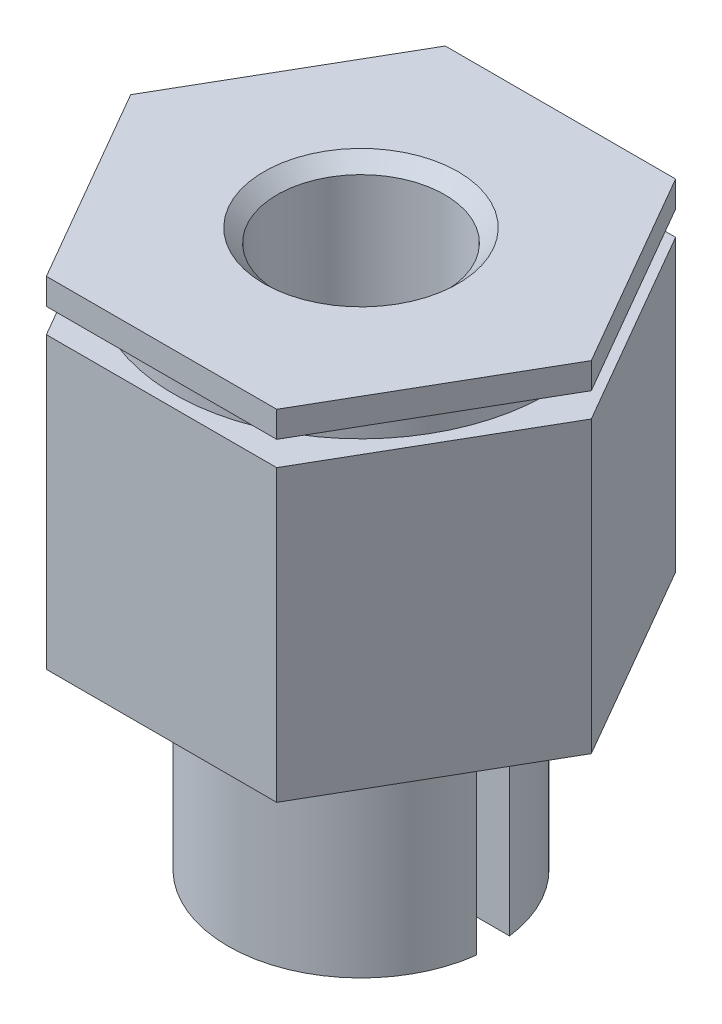
ISO-10303-21;
HEADER;
FILE_DESCRIPTION(('STEP AP214'),'2;1');
FILE_NAME('part.step','',(''),(''),'','','');
FILE_SCHEMA(('AUTOMOTIVE_DESIGN { 1 0 10303 214 1 1 1 1 }'));
ENDSEC;
DATA;
#1=APPLICATION_CONTEXT('core data for automotive mechanical design processes');
#2=APPLICATION_PROTOCOL_DEFINITION('international standard','automotive_design',2000,#1);
#3=PRODUCT_CONTEXT('',#1,'mechanical');
#4=PRODUCT('Part','Part','',(#3));
#5=PRODUCT_RELATED_PRODUCT_CATEGORY('part','',(#4));
#6=PRODUCT_DEFINITION_FORMATION('','',#4);
#7=PRODUCT_DEFINITION_CONTEXT('part definition',#1,'design');
#8=PRODUCT_DEFINITION('design','',#6,#7);
#9=PRODUCT_DEFINITION_SHAPE('','',#8);
#10=(LENGTH_UNIT() NAMED_UNIT(*) SI_UNIT(.MILLI.,.METRE.));
#11=(NAMED_UNIT(*) PLANE_ANGLE_UNIT() SI_UNIT($,.RADIAN.));
#12=(NAMED_UNIT(*) SI_UNIT($,.STERADIAN.) SOLID_ANGLE_UNIT());
#13=UNCERTAINTY_MEASURE_WITH_UNIT(LENGTH_MEASURE(1.E-05),#10,'distance_accuracy_value','');
#14=(GEOMETRIC_REPRESENTATION_CONTEXT(3) GLOBAL_UNCERTAINTY_ASSIGNED_CONTEXT((#13)) GLOBAL_UNIT_ASSIGNED_CONTEXT((#10,
#11,#12)) REPRESENTATION_CONTEXT('',''));
#15=CARTESIAN_POINT('',(0.,0.,0.));
#16=DIRECTION('',(0.,0.,1.));
#17=DIRECTION('',(1.,0.,0.));
#18=AXIS2_PLACEMENT_3D('',#15,#16,#17);
#19=CARTESIAN_POINT('',(0.,25.35682,0.));
#20=DIRECTION('',(0.,-1.,0.));
#21=DIRECTION('',(0.,0.,-1.));
#22=AXIS2_PLACEMENT_3D('',#19,#20,#21);
#23=CYLINDRICAL_SURFACE('',#22,8.9408);
#24=CARTESIAN_POINT('',(0.,24.13,0.));
#25=DIRECTION('',(0.,-1.,0.));
#26=DIRECTION('',(0.,0.,-1.));
#27=AXIS2_PLACEMENT_3D('',#24,#25,#26);
#28=CIRCLE('',#27,8.9408);
#29=CARTESIAN_POINT('',(0.,24.13,-8.9408));
#30=VERTEX_POINT('',#29);
#31=EDGE_CURVE('E19',#30,#30,#28,.F.);
#32=ORIENTED_EDGE('',*,*,#31,.T.);
#33=EDGE_LOOP('',(#32));
#34=FACE_BOUND('',#33,.T.);
#35=CARTESIAN_POINT('',(0.,25.2984,0.));
#36=DIRECTION('',(0.,-1.,0.));
#37=DIRECTION('',(0.,0.,-1.));
#38=AXIS2_PLACEMENT_3D('',#35,#36,#37);
#39=CIRCLE('',#38,8.9408);
#40=CARTESIAN_POINT('',(0.,25.2984,-8.9408));
#41=VERTEX_POINT('',#40);
#42=EDGE_CURVE('E192',#41,#41,#39,.F.);
#43=ORIENTED_EDGE('',*,*,#42,.F.);
#44=EDGE_LOOP('',(#43));
#45=FACE_BOUND('',#44,.T.);
#46=ADVANCED_FACE('F16',(#34,#45),#23,.T.);
#47=CARTESIAN_POINT('',(0.,24.13,0.));
#48=DIRECTION('',(0.,-1.,0.));
#49=DIRECTION('',(0.,0.,-1.));
#50=AXIS2_PLACEMENT_3D('',#47,#48,#49);
#51=PLANE('',#50);
#52=ORIENTED_EDGE('',*,*,#31,.F.);
#53=EDGE_LOOP('',(#52));
#54=FACE_BOUND('',#53,.T.);
#55=DIRECTION('',(-0.500000000000017,0.,-0.866025403784429));
#56=VECTOR('',#55,1.);
#57=CARTESIAN_POINT('',(10.9985226280619,24.13,0.));
#58=LINE('',#57,#56);
#59=CARTESIAN_POINT('',(5.49926131403085,24.13,-9.52499999999995));
#60=VERTEX_POINT('',#59);
#61=CARTESIAN_POINT('',(10.998522628062,24.13,0.));
#62=VERTEX_POINT('',#61);
#63=EDGE_CURVE('E171',#60,#62,#58,.F.);
#64=ORIENTED_EDGE('',*,*,#63,.F.);
#65=DIRECTION('',(-1.,0.,0.));
#66=VECTOR('',#65,1.);
#67=CARTESIAN_POINT('',(5.49926131403094,24.13,-9.525));
#68=LINE('',#67,#66);
#69=CARTESIAN_POINT('',(-5.49926131403094,24.13,-9.525));
#70=VERTEX_POINT('',#69);
#71=EDGE_CURVE('E177',#70,#60,#68,.F.);
#72=ORIENTED_EDGE('',*,*,#71,.F.);
#73=DIRECTION('',(-0.500000000000017,0.,0.866025403784429));
#74=VECTOR('',#73,1.);
#75=CARTESIAN_POINT('',(-5.49926131403094,24.13,-9.525));
#76=LINE('',#75,#74);
#77=CARTESIAN_POINT('',(-10.998522628062,24.13,0.));
#78=VERTEX_POINT('',#77);
#79=EDGE_CURVE('E183',#78,#70,#76,.F.);
#80=ORIENTED_EDGE('',*,*,#79,.F.);
#81=DIRECTION('',(0.500000000000017,0.,0.866025403784429));
#82=VECTOR('',#81,1.);
#83=CARTESIAN_POINT('',(-10.9985226280619,24.13,0.));
#84=LINE('',#83,#82);
#85=CARTESIAN_POINT('',(-5.49926131403075,24.13,9.5249999999999));
#86=VERTEX_POINT('',#85);
#87=EDGE_CURVE('E189',#86,#78,#84,.F.);
#88=ORIENTED_EDGE('',*,*,#87,.F.);
#89=DIRECTION('',(1.,0.,0.));
#90=VECTOR('',#89,1.);
#91=CARTESIAN_POINT('',(-5.49926131403094,24.13,9.525));
#92=LINE('',#91,#90);
#93=CARTESIAN_POINT('',(5.49926131403094,24.13,9.525));
#94=VERTEX_POINT('',#93);
#95=EDGE_CURVE('E156',#94,#86,#92,.F.);
#96=ORIENTED_EDGE('',*,*,#95,.F.);
#97=DIRECTION('',(0.500000000000017,0.,-0.866025403784429));
#98=VECTOR('',#97,1.);
#99=CARTESIAN_POINT('',(5.49926131403094,24.13,9.525));
#100=LINE('',#99,#98);
#101=EDGE_CURVE('E165',#62,#94,#100,.F.);
#102=ORIENTED_EDGE('',*,*,#101,.F.);
#103=EDGE_LOOP('',(#64,#72,#80,#88,#96,#102));
#104=FACE_BOUND('',#103,.T.);
#105=ADVANCED_FACE('F222',(#54,#104),#51,.F.);
#106=CARTESIAN_POINT('',(0.,25.2984,0.));
#107=DIRECTION('',(0.,-1.,0.));
#108=DIRECTION('',(0.,0.,-1.));
#109=AXIS2_PLACEMENT_3D('',#106,#107,#108);
#110=PLANE('',#109);
#111=ORIENTED_EDGE('',*,*,#42,.T.);
#112=EDGE_LOOP('',(#111));
#113=FACE_BOUND('',#112,.T.);
#114=DIRECTION('',(0.500000000000017,0.,-0.866025403784429));
#115=VECTOR('',#114,1.);
#116=CARTESIAN_POINT('',(5.49926131403094,25.2984,9.525));
#117=LINE('',#116,#115);
#118=CARTESIAN_POINT('',(5.49926131403094,25.2984,9.525));
#119=VERTEX_POINT('',#118);
#120=CARTESIAN_POINT('',(10.9985226280621,25.2984,1.05182136285921E-13));
#121=VERTEX_POINT('',#120);
#122=EDGE_CURVE('E153',#119,#121,#117,.T.);
#123=ORIENTED_EDGE('',*,*,#122,.F.);
#124=DIRECTION('',(1.,0.,0.));
#125=VECTOR('',#124,1.);
#126=CARTESIAN_POINT('',(-5.49926131403094,25.2984,9.525));
#127=LINE('',#126,#125);
#128=CARTESIAN_POINT('',(-5.49926131403075,25.2984,9.5249999999999));
#129=VERTEX_POINT('',#128);
#130=EDGE_CURVE('E119',#129,#119,#127,.T.);
#131=ORIENTED_EDGE('',*,*,#130,.F.);
#132=DIRECTION('',(0.500000000000017,0.,0.866025403784429));
#133=VECTOR('',#132,1.);
#134=CARTESIAN_POINT('',(-10.9985226280619,25.2984,0.));
#135=LINE('',#134,#133);
#136=CARTESIAN_POINT('',(-10.9985226280621,25.2984,-1.05182136285921E-13));
#137=VERTEX_POINT('',#136);
#138=EDGE_CURVE('E129',#137,#129,#135,.T.);
#139=ORIENTED_EDGE('',*,*,#138,.F.);
#140=DIRECTION('',(-0.500000000000017,0.,0.866025403784429));
#141=VECTOR('',#140,1.);
#142=CARTESIAN_POINT('',(-5.49926131403094,25.2984,-9.525));
#143=LINE('',#142,#141);
#144=CARTESIAN_POINT('',(-5.49926131403094,25.2984,-9.525));
#145=VERTEX_POINT('',#144);
#146=EDGE_CURVE('E135',#145,#137,#143,.T.);
#147=ORIENTED_EDGE('',*,*,#146,.F.);
#148=DIRECTION('',(-1.,0.,0.));
#149=VECTOR('',#148,1.);
#150=CARTESIAN_POINT('',(5.49926131403094,25.2984,-9.525));
#151=LINE('',#150,#149);
#152=CARTESIAN_POINT('',(5.49926131403075,25.2984,-9.5249999999999));
#153=VERTEX_POINT('',#152);
#154=EDGE_CURVE('E141',#153,#145,#151,.T.);
#155=ORIENTED_EDGE('',*,*,#154,.F.);
#156=DIRECTION('',(-0.500000000000017,0.,-0.866025403784429));
#157=VECTOR('',#156,1.);
#158=CARTESIAN_POINT('',(10.9985226280619,25.2984,0.));
#159=LINE('',#158,#157);
#160=EDGE_CURVE('E147',#121,#153,#159,.T.);
#161=ORIENTED_EDGE('',*,*,#160,.F.);
#162=EDGE_LOOP('',(#123,#131,#139,#147,#155,#161));
#163=FACE_BOUND('',#162,.T.);
#164=ADVANCED_FACE('F225',(#113,#163),#110,.T.);
#165=CARTESIAN_POINT('',(-10.9985226280619,0.,0.));
#166=DIRECTION('',(-0.866025403784429,0.,0.500000000000017));
#167=DIRECTION('',(0.500000000000017,0.,0.866025403784429));
#168=AXIS2_PLACEMENT_3D('',#165,#166,#167);
#169=PLANE('',#168);
#170=DIRECTION('',(0.,1.,0.));
#171=VECTOR('',#170,1.);
#172=CARTESIAN_POINT('',(-5.49926131403094,0.,9.525));
#173=LINE('',#172,#171);
#174=CARTESIAN_POINT('',(-5.49926131403075,10.287,9.5249999999999));
#175=VERTEX_POINT('',#174);
#176=EDGE_CURVE('E162',#86,#175,#173,.F.);
#177=ORIENTED_EDGE('',*,*,#176,.F.);
#178=ORIENTED_EDGE('',*,*,#87,.T.);
#179=DIRECTION('',(0.,1.,0.));
#180=VECTOR('',#179,1.);
#181=CARTESIAN_POINT('',(-10.9985226280622,0.,-2.09901540593194E-13));
#182=LINE('',#181,#180);
#183=CARTESIAN_POINT('',(-10.998522628062,10.287,0.));
#184=VERTEX_POINT('',#183);
#185=EDGE_CURVE('E186',#184,#78,#182,.T.);
#186=ORIENTED_EDGE('',*,*,#185,.F.);
#187=DIRECTION('',(-0.499999999999983,0.,-0.866025403784448));
#188=VECTOR('',#187,1.);
#189=CARTESIAN_POINT('',(-5.49926131403094,10.287,9.525));
#190=LINE('',#189,#188);
#191=EDGE_CURVE('E122',#175,#184,#190,.T.);
#192=ORIENTED_EDGE('',*,*,#191,.F.);
#193=EDGE_LOOP('',(#177,#178,#186,#192));
#194=FACE_BOUND('',#193,.T.);
#195=ADVANCED_FACE('F367',(#194),#169,.T.);
#196=CARTESIAN_POINT('',(-5.49926131403094,0.,-9.525));
#197=DIRECTION('',(-0.866025403784429,0.,-0.500000000000017));
#198=DIRECTION('',(-0.500000000000017,0.,0.866025403784429));
#199=AXIS2_PLACEMENT_3D('',#196,#197,#198);
#200=PLANE('',#199);
#201=ORIENTED_EDGE('',*,*,#185,.T.);
#202=ORIENTED_EDGE('',*,*,#79,.T.);
#203=DIRECTION('',(0.,1.,0.));
#204=VECTOR('',#203,1.);
#205=CARTESIAN_POINT('',(-5.49926131403094,0.,-9.525));
#206=LINE('',#205,#204);
#207=CARTESIAN_POINT('',(-5.49926131403094,10.287,-9.525));
#208=VERTEX_POINT('',#207);
#209=EDGE_CURVE('E180',#208,#70,#206,.T.);
#210=ORIENTED_EDGE('',*,*,#209,.F.);
#211=DIRECTION('',(0.499999999999983,0.,-0.866025403784448));
#212=VECTOR('',#211,1.);
#213=CARTESIAN_POINT('',(-10.9985226280619,10.287,0.));
#214=LINE('',#213,#212);
#215=EDGE_CURVE('E265',#184,#208,#214,.T.);
#216=ORIENTED_EDGE('',*,*,#215,.F.);
#217=EDGE_LOOP('',(#201,#202,#210,#216));
#218=FACE_BOUND('',#217,.T.);
#219=ADVANCED_FACE('F371',(#218),#200,.T.);
#220=CARTESIAN_POINT('',(5.49926131403094,0.,-9.525));
#221=DIRECTION('',(0.,0.,-1.));
#222=DIRECTION('',(-1.,0.,0.));
#223=AXIS2_PLACEMENT_3D('',#220,#221,#222);
#224=PLANE('',#223);
#225=ORIENTED_EDGE('',*,*,#209,.T.);
#226=ORIENTED_EDGE('',*,*,#71,.T.);
#227=DIRECTION('',(0.,1.,0.));
#228=VECTOR('',#227,1.);
#229=CARTESIAN_POINT('',(5.49926131403057,0.,-9.52499999999979));
#230=LINE('',#229,#228);
#231=CARTESIAN_POINT('',(5.49926131403085,10.287,-9.52499999999995));
#232=VERTEX_POINT('',#231);
#233=EDGE_CURVE('E174',#232,#60,#230,.T.);
#234=ORIENTED_EDGE('',*,*,#233,.F.);
#235=DIRECTION('',(1.,0.,0.));
#236=VECTOR('',#235,1.);
#237=CARTESIAN_POINT('',(0.,10.287,-9.525));
#238=LINE('',#237,#236);
#239=EDGE_CURVE('E259',#208,#232,#238,.T.);
#240=ORIENTED_EDGE('',*,*,#239,.F.);
#241=EDGE_LOOP('',(#225,#226,#234,#240));
#242=FACE_BOUND('',#241,.T.);
#243=ADVANCED_FACE('F571',(#242),#224,.T.);
#244=CARTESIAN_POINT('',(10.9985226280619,0.,0.));
#245=DIRECTION('',(0.866025403784429,0.,-0.500000000000017));
#246=DIRECTION('',(-0.500000000000017,0.,-0.866025403784429));
#247=AXIS2_PLACEMENT_3D('',#244,#245,#246);
#248=PLANE('',#247);
#249=ORIENTED_EDGE('',*,*,#233,.T.);
#250=ORIENTED_EDGE('',*,*,#63,.T.);
#251=DIRECTION('',(0.,1.,0.));
#252=VECTOR('',#251,1.);
#253=CARTESIAN_POINT('',(10.9985226280622,0.,2.09901540593194E-13));
#254=LINE('',#253,#252);
#255=CARTESIAN_POINT('',(10.998522628062,10.287,0.));
#256=VERTEX_POINT('',#255);
#257=EDGE_CURVE('E168',#256,#62,#254,.T.);
#258=ORIENTED_EDGE('',*,*,#257,.F.);
#259=DIRECTION('',(0.499999999999983,0.,0.866025403784448));
#260=VECTOR('',#259,1.);
#261=CARTESIAN_POINT('',(5.49926131403094,10.287,-9.525));
#262=LINE('',#261,#260);
#263=EDGE_CURVE('E256',#232,#256,#262,.T.);
#264=ORIENTED_EDGE('',*,*,#263,.F.);
#265=EDGE_LOOP('',(#249,#250,#258,#264));
#266=FACE_BOUND('',#265,.T.);
#267=ADVANCED_FACE('F237',(#266),#248,.T.);
#268=CARTESIAN_POINT('',(5.49926131403094,0.,9.525));
#269=DIRECTION('',(0.866025403784429,0.,0.500000000000017));
#270=DIRECTION('',(0.500000000000017,0.,-0.866025403784429));
#271=AXIS2_PLACEMENT_3D('',#268,#269,#270);
#272=PLANE('',#271);
#273=ORIENTED_EDGE('',*,*,#257,.T.);
#274=ORIENTED_EDGE('',*,*,#101,.T.);
#275=DIRECTION('',(0.,1.,0.));
#276=VECTOR('',#275,1.);
#277=CARTESIAN_POINT('',(5.49926131403094,0.,9.525));
#278=LINE('',#277,#276);
#279=CARTESIAN_POINT('',(5.49926131403094,10.287,9.525));
#280=VERTEX_POINT('',#279);
#281=EDGE_CURVE('E159',#280,#94,#278,.T.);
#282=ORIENTED_EDGE('',*,*,#281,.F.);
#283=DIRECTION('',(-0.499999999999983,0.,0.866025403784448));
#284=VECTOR('',#283,1.);
#285=CARTESIAN_POINT('',(10.9985226280619,10.287,0.));
#286=LINE('',#285,#284);
#287=EDGE_CURVE('E249',#256,#280,#286,.T.);
#288=ORIENTED_EDGE('',*,*,#287,.F.);
#289=EDGE_LOOP('',(#273,#274,#282,#288));
#290=FACE_BOUND('',#289,.T.);
#291=ADVANCED_FACE('F245',(#290),#272,.T.);
#292=CARTESIAN_POINT('',(-5.49926131403094,0.,9.525));
#293=DIRECTION('',(0.,0.,1.));
#294=DIRECTION('',(1.,0.,0.));
#295=AXIS2_PLACEMENT_3D('',#292,#293,#294);
#296=PLANE('',#295);
#297=ORIENTED_EDGE('',*,*,#281,.T.);
#298=ORIENTED_EDGE('',*,*,#95,.T.);
#299=ORIENTED_EDGE('',*,*,#176,.T.);
#300=DIRECTION('',(1.,0.,0.));
#301=VECTOR('',#300,1.);
#302=CARTESIAN_POINT('',(0.,10.287,9.525));
#303=LINE('',#302,#301);
#304=EDGE_CURVE('E213',#280,#175,#303,.F.);
#305=ORIENTED_EDGE('',*,*,#304,.F.);
#306=EDGE_LOOP('',(#297,#298,#299,#305));
#307=FACE_BOUND('',#306,.T.);
#308=ADVANCED_FACE('F375',(#307),#296,.T.);
#309=CARTESIAN_POINT('',(5.49926131403094,0.,9.525));
#310=DIRECTION('',(0.866025403784429,0.,0.500000000000017));
#311=DIRECTION('',(0.500000000000017,0.,-0.866025403784429));
#312=AXIS2_PLACEMENT_3D('',#309,#310,#311);
#313=PLANE('',#312);
#314=DIRECTION('',(0.,1.,0.));
#315=VECTOR('',#314,1.);
#316=CARTESIAN_POINT('',(5.49926131403094,0.,9.525));
#317=LINE('',#316,#315);
#318=CARTESIAN_POINT('',(5.49926131403094,26.543,9.525));
#319=VERTEX_POINT('',#318);
#320=EDGE_CURVE('E126',#119,#319,#317,.T.);
#321=ORIENTED_EDGE('',*,*,#320,.F.);
#322=ORIENTED_EDGE('',*,*,#122,.T.);
#323=DIRECTION('',(0.,1.,0.));
#324=VECTOR('',#323,1.);
#325=CARTESIAN_POINT('',(10.9985226280619,0.,0.));
#326=LINE('',#325,#324);
#327=CARTESIAN_POINT('',(10.9985226280621,26.543,1.03852042569284E-13));
#328=VERTEX_POINT('',#327);
#329=EDGE_CURVE('E150',#328,#121,#326,.F.);
#330=ORIENTED_EDGE('',*,*,#329,.F.);
#331=DIRECTION('',(0.499999999999983,0.,-0.866025403784448));
#332=VECTOR('',#331,1.);
#333=CARTESIAN_POINT('',(5.49926131403094,26.543,9.525));
#334=LINE('',#333,#332);
#335=EDGE_CURVE('E100',#319,#328,#334,.T.);
#336=ORIENTED_EDGE('',*,*,#335,.F.);
#337=EDGE_LOOP('',(#321,#322,#330,#336));
#338=FACE_BOUND('',#337,.T.);
#339=ADVANCED_FACE('F319',(#338),#313,.T.);
#340=CARTESIAN_POINT('',(10.9985226280619,0.,0.));
#341=DIRECTION('',(0.866025403784429,0.,-0.500000000000017));
#342=DIRECTION('',(-0.500000000000017,0.,-0.866025403784429));
#343=AXIS2_PLACEMENT_3D('',#340,#341,#342);
#344=PLANE('',#343);
#345=ORIENTED_EDGE('',*,*,#329,.T.);
#346=ORIENTED_EDGE('',*,*,#160,.T.);
#347=DIRECTION('',(0.,1.,0.));
#348=VECTOR('',#347,1.);
#349=CARTESIAN_POINT('',(5.49926131403094,0.,-9.525));
#350=LINE('',#349,#348);
#351=CARTESIAN_POINT('',(5.49926131403075,26.543,-9.5249999999999));
#352=VERTEX_POINT('',#351);
#353=EDGE_CURVE('E144',#352,#153,#350,.F.);
#354=ORIENTED_EDGE('',*,*,#353,.F.);
#355=DIRECTION('',(-0.499999999999983,0.,-0.866025403784448));
#356=VECTOR('',#355,1.);
#357=CARTESIAN_POINT('',(10.9985226280619,26.543,0.));
#358=LINE('',#357,#356);
#359=EDGE_CURVE('E303',#328,#352,#358,.T.);
#360=ORIENTED_EDGE('',*,*,#359,.F.);
#361=EDGE_LOOP('',(#345,#346,#354,#360));
#362=FACE_BOUND('',#361,.T.);
#363=ADVANCED_FACE('F324',(#362),#344,.T.);
#364=CARTESIAN_POINT('',(5.49926131403094,0.,-9.525));
#365=DIRECTION('',(0.,0.,-1.));
#366=DIRECTION('',(-1.,0.,0.));
#367=AXIS2_PLACEMENT_3D('',#364,#365,#366);
#368=PLANE('',#367);
#369=ORIENTED_EDGE('',*,*,#353,.T.);
#370=ORIENTED_EDGE('',*,*,#154,.T.);
#371=DIRECTION('',(0.,1.,0.));
#372=VECTOR('',#371,1.);
#373=CARTESIAN_POINT('',(-5.49926131403094,0.,-9.525));
#374=LINE('',#373,#372);
#375=CARTESIAN_POINT('',(-5.49926131403094,26.543,-9.525));
#376=VERTEX_POINT('',#375);
#377=EDGE_CURVE('E138',#376,#145,#374,.F.);
#378=ORIENTED_EDGE('',*,*,#377,.F.);
#379=DIRECTION('',(1.,0.,0.));
#380=VECTOR('',#379,1.);
#381=CARTESIAN_POINT('',(0.,26.543,-9.525));
#382=LINE('',#381,#380);
#383=EDGE_CURVE('E300',#352,#376,#382,.F.);
#384=ORIENTED_EDGE('',*,*,#383,.F.);
#385=EDGE_LOOP('',(#369,#370,#378,#384));
#386=FACE_BOUND('',#385,.T.);
#387=ADVANCED_FACE('F332',(#386),#368,.T.);
#388=CARTESIAN_POINT('',(-5.49926131403094,0.,-9.525));
#389=DIRECTION('',(-0.866025403784429,0.,-0.500000000000017));
#390=DIRECTION('',(-0.500000000000017,0.,0.866025403784429));
#391=AXIS2_PLACEMENT_3D('',#388,#389,#390);
#392=PLANE('',#391);
#393=ORIENTED_EDGE('',*,*,#377,.T.);
#394=ORIENTED_EDGE('',*,*,#146,.T.);
#395=DIRECTION('',(0.,1.,0.));
#396=VECTOR('',#395,1.);
#397=CARTESIAN_POINT('',(-10.9985226280619,0.,0.));
#398=LINE('',#397,#396);
#399=CARTESIAN_POINT('',(-10.9985226280621,26.543,-1.03852042569284E-13));
#400=VERTEX_POINT('',#399);
#401=EDGE_CURVE('E132',#400,#137,#398,.F.);
#402=ORIENTED_EDGE('',*,*,#401,.F.);
#403=DIRECTION('',(-0.499999999999983,0.,0.866025403784448));
#404=VECTOR('',#403,1.);
#405=CARTESIAN_POINT('',(-5.49926131403094,26.543,-9.525));
#406=LINE('',#405,#404);
#407=EDGE_CURVE('E297',#376,#400,#406,.T.);
#408=ORIENTED_EDGE('',*,*,#407,.F.);
#409=EDGE_LOOP('',(#393,#394,#402,#408));
#410=FACE_BOUND('',#409,.T.);
#411=ADVANCED_FACE('F435',(#410),#392,.T.);
#412=CARTESIAN_POINT('',(-10.9985226280619,0.,0.));
#413=DIRECTION('',(-0.866025403784429,0.,0.500000000000017));
#414=DIRECTION('',(0.500000000000017,0.,0.866025403784429));
#415=AXIS2_PLACEMENT_3D('',#412,#413,#414);
#416=PLANE('',#415);
#417=ORIENTED_EDGE('',*,*,#401,.T.);
#418=ORIENTED_EDGE('',*,*,#138,.T.);
#419=DIRECTION('',(0.,1.,0.));
#420=VECTOR('',#419,1.);
#421=CARTESIAN_POINT('',(-5.49926131403094,0.,9.525));
#422=LINE('',#421,#420);
#423=CARTESIAN_POINT('',(-5.49926131403075,26.543,9.5249999999999));
#424=VERTEX_POINT('',#423);
#425=EDGE_CURVE('E123',#424,#129,#422,.F.);
#426=ORIENTED_EDGE('',*,*,#425,.F.);
#427=DIRECTION('',(0.499999999999983,0.,0.866025403784448));
#428=VECTOR('',#427,1.);
#429=CARTESIAN_POINT('',(-10.9985226280619,26.543,0.));
#430=LINE('',#429,#428);
#431=EDGE_CURVE('E294',#400,#424,#430,.T.);
#432=ORIENTED_EDGE('',*,*,#431,.F.);
#433=EDGE_LOOP('',(#417,#418,#426,#432));
#434=FACE_BOUND('',#433,.T.);
#435=ADVANCED_FACE('F431',(#434),#416,.T.);
#436=CARTESIAN_POINT('',(-5.49926131403094,0.,9.525));
#437=DIRECTION('',(0.,0.,1.));
#438=DIRECTION('',(1.,0.,0.));
#439=AXIS2_PLACEMENT_3D('',#436,#437,#438);
#440=PLANE('',#439);
#441=ORIENTED_EDGE('',*,*,#425,.T.);
#442=ORIENTED_EDGE('',*,*,#130,.T.);
#443=ORIENTED_EDGE('',*,*,#320,.T.);
#444=DIRECTION('',(1.,0.,0.));
#445=VECTOR('',#444,1.);
#446=CARTESIAN_POINT('',(0.,26.543,9.525));
#447=LINE('',#446,#445);
#448=EDGE_CURVE('E291',#424,#319,#447,.T.);
#449=ORIENTED_EDGE('',*,*,#448,.F.);
#450=EDGE_LOOP('',(#441,#442,#443,#449));
#451=FACE_BOUND('',#450,.T.);
#452=ADVANCED_FACE('F428',(#451),#440,.T.);
#453=CARTESIAN_POINT('',(0.,0.,0.));
#454=DIRECTION('',(0.,-1.,0.));
#455=DIRECTION('',(0.,0.,-1.));
#456=AXIS2_PLACEMENT_3D('',#453,#454,#455);
#457=CYLINDRICAL_SURFACE('',#456,6.35);
#458=CARTESIAN_POINT('',(0.,0.,0.));
#459=DIRECTION('',(0.,-1.,0.));
#460=DIRECTION('',(0.,0.,-1.));
#461=AXIS2_PLACEMENT_3D('',#458,#459,#460);
#462=CIRCLE('',#461,6.35);
#463=CARTESIAN_POINT('',(6.30019530947249,0.,-0.79375));
#464=VERTEX_POINT('',#463);
#465=CARTESIAN_POINT('',(-6.30019530947249,0.,-0.79375));
#466=VERTEX_POINT('',#465);
#467=EDGE_CURVE('E109',#464,#466,#462,.F.);
#468=ORIENTED_EDGE('',*,*,#467,.T.);
#469=DIRECTION('',(0.,1.,0.));
#470=VECTOR('',#469,1.);
#471=CARTESIAN_POINT('',(-6.30019530947242,0.,-0.79375));
#472=LINE('',#471,#470);
#473=CARTESIAN_POINT('',(-6.30019530947249,10.287,-0.79375));
#474=VERTEX_POINT('',#473);
#475=EDGE_CURVE('E103',#466,#474,#472,.T.);
#476=ORIENTED_EDGE('',*,*,#475,.T.);
#477=CARTESIAN_POINT('',(0.,10.287,0.));
#478=DIRECTION('',(0.,-1.,0.));
#479=DIRECTION('',(0.,0.,-1.));
#480=AXIS2_PLACEMENT_3D('',#477,#478,#479);
#481=CIRCLE('',#480,6.35);
#482=CARTESIAN_POINT('',(6.30019530947249,10.287,-0.79375));
#483=VERTEX_POINT('',#482);
#484=EDGE_CURVE('E90',#483,#474,#481,.F.);
#485=ORIENTED_EDGE('',*,*,#484,.F.);
#486=DIRECTION('',(0.,1.,0.));
#487=VECTOR('',#486,1.);
#488=CARTESIAN_POINT('',(6.30019530947242,0.,-0.79375));
#489=LINE('',#488,#487);
#490=EDGE_CURVE('E116',#483,#464,#489,.F.);
#491=ORIENTED_EDGE('',*,*,#490,.T.);
#492=EDGE_LOOP('',(#468,#476,#485,#491));
#493=FACE_BOUND('',#492,.T.);
#494=ADVANCED_FACE('F107',(#493),#457,.T.);
#495=CARTESIAN_POINT('',(0.,0.,0.));
#496=DIRECTION('',(0.,-1.,0.));
#497=DIRECTION('',(0.,0.,-1.));
#498=AXIS2_PLACEMENT_3D('',#495,#496,#497);
#499=CYLINDRICAL_SURFACE('',#498,6.35);
#500=CARTESIAN_POINT('',(0.,0.,0.));
#501=DIRECTION('',(0.,-1.,0.));
#502=DIRECTION('',(0.,0.,-1.));
#503=AXIS2_PLACEMENT_3D('',#500,#501,#502);
#504=CIRCLE('',#503,6.35);
#505=CARTESIAN_POINT('',(-6.30019530947249,0.,0.79375));
#506=VERTEX_POINT('',#505);
#507=CARTESIAN_POINT('',(6.30019530947249,0.,0.79375));
#508=VERTEX_POINT('',#507);
#509=EDGE_CURVE('E205',#506,#508,#504,.F.);
#510=ORIENTED_EDGE('',*,*,#509,.T.);
#511=DIRECTION('',(0.,1.,0.));
#512=VECTOR('',#511,1.);
#513=CARTESIAN_POINT('',(6.30019530947242,0.,0.79375));
#514=LINE('',#513,#512);
#515=CARTESIAN_POINT('',(6.30019530947249,10.287,0.79375));
#516=VERTEX_POINT('',#515);
#517=EDGE_CURVE('E270',#508,#516,#514,.T.);
#518=ORIENTED_EDGE('',*,*,#517,.T.);
#519=CARTESIAN_POINT('',(0.,10.287,0.));
#520=DIRECTION('',(0.,-1.,0.));
#521=DIRECTION('',(0.,0.,-1.));
#522=AXIS2_PLACEMENT_3D('',#519,#520,#521);
#523=CIRCLE('',#522,6.35);
#524=CARTESIAN_POINT('',(-6.30019530947249,10.287,0.79375));
#525=VERTEX_POINT('',#524);
#526=EDGE_CURVE('E211',#525,#516,#523,.F.);
#527=ORIENTED_EDGE('',*,*,#526,.F.);
#528=DIRECTION('',(0.,1.,0.));
#529=VECTOR('',#528,1.);
#530=CARTESIAN_POINT('',(-6.30019530947242,0.,0.79375));
#531=LINE('',#530,#529);
#532=EDGE_CURVE('E113',#525,#506,#531,.F.);
#533=ORIENTED_EDGE('',*,*,#532,.T.);
#534=EDGE_LOOP('',(#510,#518,#527,#533));
#535=FACE_BOUND('',#534,.T.);
#536=ADVANCED_FACE('F422',(#535),#499,.T.);
#537=CARTESIAN_POINT('',(0.,10.287,0.));
#538=DIRECTION('',(0.,-1.,0.));
#539=DIRECTION('',(0.,0.,-1.));
#540=AXIS2_PLACEMENT_3D('',#537,#538,#539);
#541=PLANE('',#540);
#542=DIRECTION('',(-1.,0.,0.));
#543=VECTOR('',#542,1.);
#544=CARTESIAN_POINT('',(-6.30019530947242,10.287,-0.79375));
#545=LINE('',#544,#543);
#546=CARTESIAN_POINT('',(3.92045417490044,10.287,-0.793749999999772));
#547=VERTEX_POINT('',#546);
#548=EDGE_CURVE('E96',#547,#483,#545,.F.);
#549=ORIENTED_EDGE('',*,*,#548,.T.);
#550=ORIENTED_EDGE('',*,*,#484,.T.);
#551=DIRECTION('',(-1.,0.,0.));
#552=VECTOR('',#551,1.);
#553=CARTESIAN_POINT('',(-6.30019530947242,10.287,-0.79375));
#554=LINE('',#553,#552);
#555=CARTESIAN_POINT('',(-3.92045417490039,10.287,-0.793750000000019));
#556=VERTEX_POINT('',#555);
#557=EDGE_CURVE('E94',#474,#556,#554,.F.);
#558=ORIENTED_EDGE('',*,*,#557,.T.);
#559=CARTESIAN_POINT('',(0.,10.287,0.));
#560=DIRECTION('',(0.,1.,0.));
#561=DIRECTION('',(0.,0.,1.));
#562=AXIS2_PLACEMENT_3D('',#559,#560,#561);
#563=CIRCLE('',#562,3.99999999999924);
#564=CARTESIAN_POINT('',(-3.92045417490039,10.287,0.793750000000019));
#565=VERTEX_POINT('',#564);
#566=EDGE_CURVE('E57',#556,#565,#563,.T.);
#567=ORIENTED_EDGE('',*,*,#566,.T.);
#568=DIRECTION('',(1.,0.,0.));
#569=VECTOR('',#568,1.);
#570=CARTESIAN_POINT('',(6.30019530947242,10.287,0.79375));
#571=LINE('',#570,#569);
#572=EDGE_CURVE('E105',#565,#525,#571,.F.);
#573=ORIENTED_EDGE('',*,*,#572,.T.);
#574=ORIENTED_EDGE('',*,*,#526,.T.);
#575=DIRECTION('',(1.,0.,0.));
#576=VECTOR('',#575,1.);
#577=CARTESIAN_POINT('',(6.30019530947242,10.287,0.79375));
#578=LINE('',#577,#576);
#579=CARTESIAN_POINT('',(3.92045417490044,10.287,0.793749999999772));
#580=VERTEX_POINT('',#579);
#581=EDGE_CURVE('E204',#516,#580,#578,.F.);
#582=ORIENTED_EDGE('',*,*,#581,.T.);
#583=CARTESIAN_POINT('',(0.,10.287,0.));
#584=DIRECTION('',(0.,1.,0.));
#585=DIRECTION('',(0.,0.,1.));
#586=AXIS2_PLACEMENT_3D('',#583,#584,#585);
#587=CIRCLE('',#586,3.99999999999924);
#588=EDGE_CURVE('E34',#580,#547,#587,.T.);
#589=ORIENTED_EDGE('',*,*,#588,.T.);
#590=EDGE_LOOP('',(#549,#550,#558,#567,#573,#574,#582,#589));
#591=FACE_BOUND('',#590,.T.);
#592=ORIENTED_EDGE('',*,*,#287,.T.);
#593=ORIENTED_EDGE('',*,*,#304,.T.);
#594=ORIENTED_EDGE('',*,*,#191,.T.);
#595=ORIENTED_EDGE('',*,*,#215,.T.);
#596=ORIENTED_EDGE('',*,*,#239,.T.);
#597=ORIENTED_EDGE('',*,*,#263,.T.);
#598=EDGE_LOOP('',(#592,#593,#594,#595,#596,#597));
#599=FACE_BOUND('',#598,.T.);
#600=ADVANCED_FACE('F92',(#591,#599),#541,.T.);
#601=CARTESIAN_POINT('',(0.,26.543,0.));
#602=DIRECTION('',(0.,1.,0.));
#603=DIRECTION('',(0.,0.,1.));
#604=AXIS2_PLACEMENT_3D('',#601,#602,#603);
#605=PLANE('',#604);
#606=CARTESIAN_POINT('',(0.,26.5430000000038,0.));
#607=DIRECTION('',(0.,1.,0.));
#608=DIRECTION('',(0.,0.,1.));
#609=AXIS2_PLACEMENT_3D('',#606,#607,#608);
#610=CIRCLE('',#609,4.63500000000749);
#611=CARTESIAN_POINT('',(0.,26.5430000000038,4.63500000000749));
#612=VERTEX_POINT('',#611);
#613=EDGE_CURVE('E201',#612,#612,#610,.F.);
#614=ORIENTED_EDGE('',*,*,#613,.T.);
#615=EDGE_LOOP('',(#614));
#616=FACE_BOUND('',#615,.T.);
#617=ORIENTED_EDGE('',*,*,#431,.T.);
#618=ORIENTED_EDGE('',*,*,#448,.T.);
#619=ORIENTED_EDGE('',*,*,#335,.T.);
#620=ORIENTED_EDGE('',*,*,#359,.T.);
#621=ORIENTED_EDGE('',*,*,#383,.T.);
#622=ORIENTED_EDGE('',*,*,#407,.T.);
#623=EDGE_LOOP('',(#617,#618,#619,#620,#621,#622));
#624=FACE_BOUND('',#623,.T.);
#625=ADVANCED_FACE('F310',(#616,#624),#605,.T.);
#626=CARTESIAN_POINT('',(-6.30019530947242,0.,-0.79375));
#627=DIRECTION('',(0.,0.,-1.));
#628=DIRECTION('',(-1.,0.,0.));
#629=AXIS2_PLACEMENT_3D('',#626,#627,#628);
#630=PLANE('',#629);
#631=ORIENTED_EDGE('',*,*,#548,.F.);
#632=DIRECTION('',(0.,1.,0.));
#633=VECTOR('',#632,1.);
#634=CARTESIAN_POINT('',(3.92045417490049,0.,-0.793749999999544));
#635=LINE('',#634,#633);
#636=CARTESIAN_POINT('',(3.92045417490044,0.,-0.793749999999772));
#637=VERTEX_POINT('',#636);
#638=EDGE_CURVE('E200',#547,#637,#635,.F.);
#639=ORIENTED_EDGE('',*,*,#638,.T.);
#640=DIRECTION('',(1.,0.,0.));
#641=VECTOR('',#640,1.);
#642=CARTESIAN_POINT('',(0.,0.,-0.79375));
#643=LINE('',#642,#641);
#644=EDGE_CURVE('E118',#637,#464,#643,.T.);
#645=ORIENTED_EDGE('',*,*,#644,.T.);
#646=ORIENTED_EDGE('',*,*,#490,.F.);
#647=EDGE_LOOP('',(#631,#639,#645,#646));
#648=FACE_BOUND('',#647,.T.);
#649=ADVANCED_FACE('F412',(#648),#630,.F.);
#650=CARTESIAN_POINT('',(0.,0.,0.));
#651=DIRECTION('',(0.,1.,0.));
#652=DIRECTION('',(0.,0.,1.));
#653=AXIS2_PLACEMENT_3D('',#650,#651,#652);
#654=PLANE('',#653);
#655=ORIENTED_EDGE('',*,*,#644,.F.);
#656=CARTESIAN_POINT('',(0.,0.,0.));
#657=DIRECTION('',(0.,1.,0.));
#658=DIRECTION('',(0.,0.,1.));
#659=AXIS2_PLACEMENT_3D('',#656,#657,#658);
#660=CIRCLE('',#659,3.99999999999924);
#661=CARTESIAN_POINT('',(-3.92045417490039,0.,-0.793750000000019));
#662=VERTEX_POINT('',#661);
#663=EDGE_CURVE('E197',#637,#662,#660,.T.);
#664=ORIENTED_EDGE('',*,*,#663,.T.);
#665=DIRECTION('',(-1.,0.,0.));
#666=VECTOR('',#665,1.);
#667=CARTESIAN_POINT('',(-6.30019530947242,0.,-0.79375));
#668=LINE('',#667,#666);
#669=EDGE_CURVE('E71',#662,#466,#668,.T.);
#670=ORIENTED_EDGE('',*,*,#669,.T.);
#671=ORIENTED_EDGE('',*,*,#467,.F.);
#672=EDGE_LOOP('',(#655,#664,#670,#671));
#673=FACE_BOUND('',#672,.T.);
#674=ADVANCED_FACE('F409',(#673),#654,.F.);
#675=CARTESIAN_POINT('',(-6.30019530947242,0.,-0.79375));
#676=DIRECTION('',(0.,0.,-1.));
#677=DIRECTION('',(-1.,0.,0.));
#678=AXIS2_PLACEMENT_3D('',#675,#676,#677);
#679=PLANE('',#678);
#680=ORIENTED_EDGE('',*,*,#557,.F.);
#681=ORIENTED_EDGE('',*,*,#475,.F.);
#682=ORIENTED_EDGE('',*,*,#669,.F.);
#683=DIRECTION('',(0.,1.,0.));
#684=VECTOR('',#683,1.);
#685=CARTESIAN_POINT('',(-3.92045417490038,0.,-0.793750000000039));
#686=LINE('',#685,#684);
#687=EDGE_CURVE('E104',#662,#556,#686,.T.);
#688=ORIENTED_EDGE('',*,*,#687,.T.);
#689=EDGE_LOOP('',(#680,#681,#682,#688));
#690=FACE_BOUND('',#689,.T.);
#691=ADVANCED_FACE('F102',(#690),#679,.F.);
#692=CARTESIAN_POINT('',(6.30019530947242,0.,0.79375));
#693=DIRECTION('',(0.,0.,1.));
#694=DIRECTION('',(1.,0.,0.));
#695=AXIS2_PLACEMENT_3D('',#692,#693,#694);
#696=PLANE('',#695);
#697=ORIENTED_EDGE('',*,*,#572,.F.);
#698=DIRECTION('',(0.,1.,0.));
#699=VECTOR('',#698,1.);
#700=CARTESIAN_POINT('',(-3.92045417490038,0.,0.793750000000038));
#701=LINE('',#700,#699);
#702=CARTESIAN_POINT('',(-3.92045417490039,0.,0.793750000000019));
#703=VERTEX_POINT('',#702);
#704=EDGE_CURVE('E196',#565,#703,#701,.F.);
#705=ORIENTED_EDGE('',*,*,#704,.T.);
#706=DIRECTION('',(1.,0.,0.));
#707=VECTOR('',#706,1.);
#708=CARTESIAN_POINT('',(0.,0.,0.79375));
#709=LINE('',#708,#707);
#710=EDGE_CURVE('E208',#703,#506,#709,.F.);
#711=ORIENTED_EDGE('',*,*,#710,.T.);
#712=ORIENTED_EDGE('',*,*,#532,.F.);
#713=EDGE_LOOP('',(#697,#705,#711,#712));
#714=FACE_BOUND('',#713,.T.);
#715=ADVANCED_FACE('F402',(#714),#696,.F.);
#716=CARTESIAN_POINT('',(0.,0.,0.));
#717=DIRECTION('',(0.,1.,0.));
#718=DIRECTION('',(0.,0.,1.));
#719=AXIS2_PLACEMENT_3D('',#716,#717,#718);
#720=PLANE('',#719);
#721=ORIENTED_EDGE('',*,*,#710,.F.);
#722=CARTESIAN_POINT('',(0.,0.,0.));
#723=DIRECTION('',(0.,1.,0.));
#724=DIRECTION('',(0.,0.,1.));
#725=AXIS2_PLACEMENT_3D('',#722,#723,#724);
#726=CIRCLE('',#725,3.99999999999924);
#727=CARTESIAN_POINT('',(3.92045417490044,0.,0.793749999999772));
#728=VERTEX_POINT('',#727);
#729=EDGE_CURVE('E193',#703,#728,#726,.T.);
#730=ORIENTED_EDGE('',*,*,#729,.T.);
#731=DIRECTION('',(1.,0.,0.));
#732=VECTOR('',#731,1.);
#733=CARTESIAN_POINT('',(6.30019530947242,0.,0.79375));
#734=LINE('',#733,#732);
#735=EDGE_CURVE('E207',#728,#508,#734,.T.);
#736=ORIENTED_EDGE('',*,*,#735,.T.);
#737=ORIENTED_EDGE('',*,*,#509,.F.);
#738=EDGE_LOOP('',(#721,#730,#736,#737));
#739=FACE_BOUND('',#738,.T.);
#740=ADVANCED_FACE('F399',(#739),#720,.F.);
#741=CARTESIAN_POINT('',(6.30019530947242,0.,0.79375));
#742=DIRECTION('',(0.,0.,1.));
#743=DIRECTION('',(1.,0.,0.));
#744=AXIS2_PLACEMENT_3D('',#741,#742,#743);
#745=PLANE('',#744);
#746=ORIENTED_EDGE('',*,*,#581,.F.);
#747=ORIENTED_EDGE('',*,*,#517,.F.);
#748=ORIENTED_EDGE('',*,*,#735,.F.);
#749=DIRECTION('',(0.,1.,0.));
#750=VECTOR('',#749,1.);
#751=CARTESIAN_POINT('',(3.92045417490049,0.,0.793749999999543));
#752=LINE('',#751,#750);
#753=EDGE_CURVE('E25',#728,#580,#752,.T.);
#754=ORIENTED_EDGE('',*,*,#753,.T.);
#755=EDGE_LOOP('',(#746,#747,#748,#754));
#756=FACE_BOUND('',#755,.T.);
#757=ADVANCED_FACE('F276',(#756),#745,.F.);
#758=CARTESIAN_POINT('',(0.,26.5430000000038,0.));
#759=DIRECTION('',(0.,1.,0.));
#760=DIRECTION('',(0.,0.,1.));
#761=AXIS2_PLACEMENT_3D('',#758,#759,#760);
#762=CONICAL_SURFACE('',#761,4.63500000000749,0.785398163397448);
#763=CARTESIAN_POINT('',(0.,25.908,0.));
#764=DIRECTION('',(0.,1.,0.));
#765=DIRECTION('',(0.,0.,1.));
#766=AXIS2_PLACEMENT_3D('',#763,#764,#765);
#767=CIRCLE('',#766,3.99999999999924);
#768=CARTESIAN_POINT('',(0.,25.908,3.99999999999924));
#769=VERTEX_POINT('',#768);
#770=EDGE_CURVE('E11',#769,#769,#767,.F.);
#771=ORIENTED_EDGE('',*,*,#770,.T.);
#772=EDGE_LOOP('',(#771));
#773=FACE_BOUND('',#772,.T.);
#774=ORIENTED_EDGE('',*,*,#613,.F.);
#775=EDGE_LOOP('',(#774));
#776=FACE_BOUND('',#775,.T.);
#777=ADVANCED_FACE('F387',(#773,#776),#762,.F.);
#778=CARTESIAN_POINT('',(0.,0.,0.));
#779=DIRECTION('',(0.,1.,0.));
#780=DIRECTION('',(0.,0.,1.));
#781=AXIS2_PLACEMENT_3D('',#778,#779,#780);
#782=CYLINDRICAL_SURFACE('',#781,3.99999999999924);
#783=ORIENTED_EDGE('',*,*,#770,.F.);
#784=EDGE_LOOP('',(#783));
#785=FACE_BOUND('',#784,.T.);
#786=ORIENTED_EDGE('',*,*,#566,.F.);
#787=ORIENTED_EDGE('',*,*,#687,.F.);
#788=ORIENTED_EDGE('',*,*,#663,.F.);
#789=ORIENTED_EDGE('',*,*,#638,.F.);
#790=ORIENTED_EDGE('',*,*,#588,.F.);
#791=ORIENTED_EDGE('',*,*,#753,.F.);
#792=ORIENTED_EDGE('',*,*,#729,.F.);
#793=ORIENTED_EDGE('',*,*,#704,.F.);
#794=EDGE_LOOP('',(#786,#787,#788,#789,#790,#791,#792,#793));
#795=FACE_BOUND('',#794,.T.);
#796=ADVANCED_FACE('F385',(#785,#795),#782,.F.);
#797=CLOSED_SHELL('',(#46,#105,#164,#195,#219,#243,#267,#291,#308,#339,#363,#387,#411,#435,#452,
#494,#536,#600,#625,#649,#674,#691,#715,#740,#757,#777,#796));
#798=MANIFOLD_SOLID_BREP('B1',#797);
#799=ADVANCED_BREP_SHAPE_REPRESENTATION('',(#18,#798),#14);
#800=SHAPE_DEFINITION_REPRESENTATION(#9,#799);
ENDSEC;
END-ISO-10303-21;
